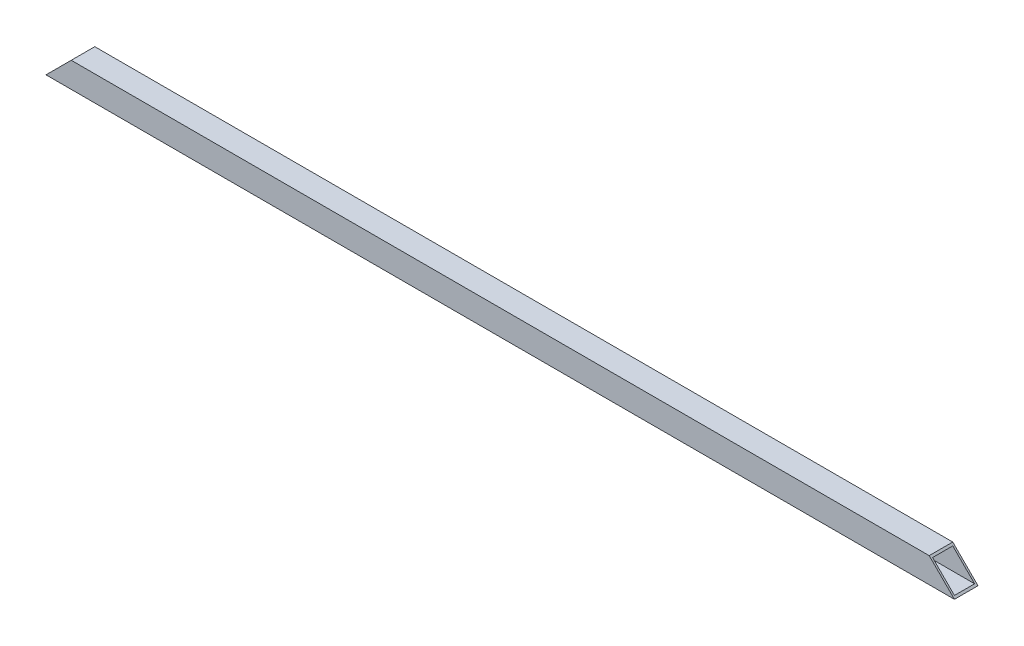
ISO-10303-21;
HEADER;
FILE_DESCRIPTION(('STEP AP214'),'2;1');
FILE_NAME('part.step','',(''),(''),'','','');
FILE_SCHEMA(('AUTOMOTIVE_DESIGN { 1 0 10303 214 1 1 1 1 }'));
ENDSEC;
DATA;
#1=APPLICATION_CONTEXT('core data for automotive mechanical design processes');
#2=APPLICATION_PROTOCOL_DEFINITION('international standard','automotive_design',2000,#1);
#3=PRODUCT_CONTEXT('',#1,'mechanical');
#4=PRODUCT('Part','Part','',(#3));
#5=PRODUCT_RELATED_PRODUCT_CATEGORY('part','',(#4));
#6=PRODUCT_DEFINITION_FORMATION('','',#4);
#7=PRODUCT_DEFINITION_CONTEXT('part definition',#1,'design');
#8=PRODUCT_DEFINITION('design','',#6,#7);
#9=PRODUCT_DEFINITION_SHAPE('','',#8);
#10=(LENGTH_UNIT() NAMED_UNIT(*) SI_UNIT(.MILLI.,.METRE.));
#11=(NAMED_UNIT(*) PLANE_ANGLE_UNIT() SI_UNIT($,.RADIAN.));
#12=(NAMED_UNIT(*) SI_UNIT($,.STERADIAN.) SOLID_ANGLE_UNIT());
#13=UNCERTAINTY_MEASURE_WITH_UNIT(LENGTH_MEASURE(1.E-05),#10,'distance_accuracy_value','');
#14=(GEOMETRIC_REPRESENTATION_CONTEXT(3) GLOBAL_UNCERTAINTY_ASSIGNED_CONTEXT((#13)) GLOBAL_UNIT_ASSIGNED_CONTEXT((#10,
#11,#12)) REPRESENTATION_CONTEXT('',''));
#15=CARTESIAN_POINT('',(0.,0.,0.));
#16=DIRECTION('',(0.,0.,1.));
#17=DIRECTION('',(1.,0.,0.));
#18=AXIS2_PLACEMENT_3D('',#15,#16,#17);
#19=CARTESIAN_POINT('',(2700.,-32.5,35.));
#20=DIRECTION('',(0.,1.,0.));
#21=DIRECTION('',(0.,0.,1.));
#22=AXIS2_PLACEMENT_3D('',#19,#20,#21);
#23=PLANE('',#22);
#24=DIRECTION('',(-1.,0.,0.));
#25=VECTOR('',#24,1.);
#26=CARTESIAN_POINT('',(2700.,-32.5,30.));
#27=LINE('',#26,#25);
#28=CARTESIAN_POINT('',(2695.,-32.5,30.));
#29=VERTEX_POINT('',#28);
#30=CARTESIAN_POINT('',(4.99999999999989,-32.5,30.));
#31=VERTEX_POINT('',#30);
#32=EDGE_CURVE('E160',#29,#31,#27,.T.);
#33=ORIENTED_EDGE('',*,*,#32,.F.);
#34=DIRECTION('',(0.,0.,-1.));
#35=VECTOR('',#34,1.);
#36=CARTESIAN_POINT('',(2695.,-32.5,35.));
#37=LINE('',#36,#35);
#38=CARTESIAN_POINT('',(2695.,-32.5,-30.));
#39=VERTEX_POINT('',#38);
#40=EDGE_CURVE('E13',#29,#39,#37,.T.);
#41=ORIENTED_EDGE('',*,*,#40,.T.);
#42=DIRECTION('',(-1.,0.,0.));
#43=VECTOR('',#42,1.);
#44=CARTESIAN_POINT('',(2700.,-32.5,-30.));
#45=LINE('',#44,#43);
#46=CARTESIAN_POINT('',(4.99999999999987,-32.5,-30.));
#47=VERTEX_POINT('',#46);
#48=EDGE_CURVE('E162',#39,#47,#45,.T.);
#49=ORIENTED_EDGE('',*,*,#48,.T.);
#50=DIRECTION('',(0.,0.,1.));
#51=VECTOR('',#50,1.);
#52=CARTESIAN_POINT('',(4.99999999999989,-32.5,35.0000000000008));
#53=LINE('',#52,#51);
#54=EDGE_CURVE('E67',#47,#31,#53,.T.);
#55=ORIENTED_EDGE('',*,*,#54,.T.);
#56=EDGE_LOOP('',(#33,#41,#49,#55));
#57=FACE_BOUND('',#56,.T.);
#58=ADVANCED_FACE('F59',(#57),#23,.T.);
#59=CARTESIAN_POINT('',(2700.,37.5,30.));
#60=DIRECTION('',(0.,0.,-1.));
#61=DIRECTION('',(0.,1.,0.));
#62=AXIS2_PLACEMENT_3D('',#59,#60,#61);
#63=PLANE('',#62);
#64=DIRECTION('',(-1.,0.,0.));
#65=VECTOR('',#64,1.);
#66=CARTESIAN_POINT('',(2700.,32.5,30.));
#67=LINE('',#66,#65);
#68=CARTESIAN_POINT('',(2630.,32.5,30.));
#69=VERTEX_POINT('',#68);
#70=CARTESIAN_POINT('',(69.9999999999998,32.5,30.));
#71=VERTEX_POINT('',#70);
#72=EDGE_CURVE('E170',#69,#71,#67,.T.);
#73=ORIENTED_EDGE('',*,*,#72,.F.);
#74=DIRECTION('',(0.707106781186546,-0.707106781186549,0.));
#75=VECTOR('',#74,1.);
#76=CARTESIAN_POINT('',(2662.5,1.17961196366423E-13,30.));
#77=LINE('',#76,#75);
#78=EDGE_CURVE('E169',#69,#29,#77,.T.);
#79=ORIENTED_EDGE('',*,*,#78,.T.);
#80=ORIENTED_EDGE('',*,*,#32,.T.);
#81=DIRECTION('',(0.707106781186546,0.707106781186549,0.));
#82=VECTOR('',#81,1.);
#83=CARTESIAN_POINT('',(1387.5,1350.,30.0000000000001));
#84=LINE('',#83,#82);
#85=EDGE_CURVE('E81',#31,#71,#84,.T.);
#86=ORIENTED_EDGE('',*,*,#85,.T.);
#87=EDGE_LOOP('',(#73,#79,#80,#86));
#88=FACE_BOUND('',#87,.T.);
#89=ADVANCED_FACE('F167',(#88),#63,.T.);
#90=CARTESIAN_POINT('',(2700.,32.5,35.));
#91=DIRECTION('',(0.,-1.,0.));
#92=DIRECTION('',(0.,0.,-1.));
#93=AXIS2_PLACEMENT_3D('',#90,#91,#92);
#94=PLANE('',#93);
#95=DIRECTION('',(-1.,0.,0.));
#96=VECTOR('',#95,1.);
#97=CARTESIAN_POINT('',(2700.,32.5,-30.));
#98=LINE('',#97,#96);
#99=CARTESIAN_POINT('',(2630.,32.5,-30.));
#100=VERTEX_POINT('',#99);
#101=CARTESIAN_POINT('',(69.9999999999998,32.5,-30.));
#102=VERTEX_POINT('',#101);
#103=EDGE_CURVE('E134',#100,#102,#98,.T.);
#104=ORIENTED_EDGE('',*,*,#103,.F.);
#105=DIRECTION('',(0.,0.,1.));
#106=VECTOR('',#105,1.);
#107=CARTESIAN_POINT('',(2630.,32.5,35.));
#108=LINE('',#107,#106);
#109=EDGE_CURVE('E199',#100,#69,#108,.T.);
#110=ORIENTED_EDGE('',*,*,#109,.T.);
#111=ORIENTED_EDGE('',*,*,#72,.T.);
#112=DIRECTION('',(0.,0.,-1.));
#113=VECTOR('',#112,1.);
#114=CARTESIAN_POINT('',(69.9999999999998,32.5,35.0000000000007));
#115=LINE('',#114,#113);
#116=EDGE_CURVE('E193',#71,#102,#115,.T.);
#117=ORIENTED_EDGE('',*,*,#116,.T.);
#118=EDGE_LOOP('',(#104,#110,#111,#117));
#119=FACE_BOUND('',#118,.T.);
#120=ADVANCED_FACE('F205',(#119),#94,.T.);
#121=CARTESIAN_POINT('',(2700.,37.5,-30.));
#122=DIRECTION('',(0.,0.,1.));
#123=DIRECTION('',(0.,-1.,0.));
#124=AXIS2_PLACEMENT_3D('',#121,#122,#123);
#125=PLANE('',#124);
#126=ORIENTED_EDGE('',*,*,#48,.F.);
#127=DIRECTION('',(-0.707106781186546,0.707106781186549,0.));
#128=VECTOR('',#127,1.);
#129=CARTESIAN_POINT('',(2662.5,1.2490009027033E-13,-30.));
#130=LINE('',#129,#128);
#131=EDGE_CURVE('E74',#39,#100,#130,.T.);
#132=ORIENTED_EDGE('',*,*,#131,.T.);
#133=ORIENTED_EDGE('',*,*,#103,.T.);
#134=DIRECTION('',(-0.707106781186546,-0.707106781186549,0.));
#135=VECTOR('',#134,1.);
#136=CARTESIAN_POINT('',(1387.5,1350.,-29.9999999999996));
#137=LINE('',#136,#135);
#138=EDGE_CURVE('E196',#102,#47,#137,.T.);
#139=ORIENTED_EDGE('',*,*,#138,.T.);
#140=EDGE_LOOP('',(#126,#132,#133,#139));
#141=FACE_BOUND('',#140,.T.);
#142=ADVANCED_FACE('F203',(#141),#125,.T.);
#143=CARTESIAN_POINT('',(74.9999999999997,37.5,35.));
#144=DIRECTION('',(-0.707106781186549,0.707106781186546,0.));
#145=DIRECTION('',(-0.707106781186546,-0.707106781186549,0.));
#146=AXIS2_PLACEMENT_3D('',#143,#144,#145);
#147=PLANE('',#146);
#148=ORIENTED_EDGE('',*,*,#116,.F.);
#149=ORIENTED_EDGE('',*,*,#85,.F.);
#150=ORIENTED_EDGE('',*,*,#54,.F.);
#151=ORIENTED_EDGE('',*,*,#138,.F.);
#152=EDGE_LOOP('',(#148,#149,#150,#151));
#153=FACE_BOUND('',#152,.T.);
#154=DIRECTION('',(0.707106781186546,0.707106781186549,0.));
#155=VECTOR('',#154,1.);
#156=CARTESIAN_POINT('',(74.9999999999997,37.5,-35.));
#157=LINE('',#156,#155);
#158=CARTESIAN_POINT('',(0.,-37.5,-35.));
#159=VERTEX_POINT('',#158);
#160=CARTESIAN_POINT('',(74.9999999999997,37.5,-35.));
#161=VERTEX_POINT('',#160);
#162=EDGE_CURVE('E128',#159,#161,#157,.T.);
#163=ORIENTED_EDGE('',*,*,#162,.F.);
#164=DIRECTION('',(0.,0.,-1.));
#165=VECTOR('',#164,1.);
#166=CARTESIAN_POINT('',(0.,-37.5,35.));
#167=LINE('',#166,#165);
#168=CARTESIAN_POINT('',(0.,-37.5,35.));
#169=VERTEX_POINT('',#168);
#170=EDGE_CURVE('E122',#169,#159,#167,.T.);
#171=ORIENTED_EDGE('',*,*,#170,.F.);
#172=DIRECTION('',(0.707106781186546,0.707106781186549,0.));
#173=VECTOR('',#172,1.);
#174=CARTESIAN_POINT('',(74.9999999999997,37.5,35.));
#175=LINE('',#174,#173);
#176=CARTESIAN_POINT('',(74.9999999999997,37.5,35.));
#177=VERTEX_POINT('',#176);
#178=EDGE_CURVE('E125',#169,#177,#175,.T.);
#179=ORIENTED_EDGE('',*,*,#178,.T.);
#180=DIRECTION('',(0.,0.,-1.));
#181=VECTOR('',#180,1.);
#182=CARTESIAN_POINT('',(74.9999999999997,37.5,35.));
#183=LINE('',#182,#181);
#184=EDGE_CURVE('E190',#177,#161,#183,.T.);
#185=ORIENTED_EDGE('',*,*,#184,.T.);
#186=EDGE_LOOP('',(#163,#171,#179,#185));
#187=FACE_BOUND('',#186,.T.);
#188=ADVANCED_FACE('F124',(#153,#187),#147,.T.);
#189=CARTESIAN_POINT('',(2700.,-37.5,35.));
#190=DIRECTION('',(0.707106781186549,0.707106781186546,0.));
#191=DIRECTION('',(-0.707106781186546,0.707106781186549,0.));
#192=AXIS2_PLACEMENT_3D('',#189,#190,#191);
#193=PLANE('',#192);
#194=ORIENTED_EDGE('',*,*,#40,.F.);
#195=ORIENTED_EDGE('',*,*,#78,.F.);
#196=ORIENTED_EDGE('',*,*,#109,.F.);
#197=ORIENTED_EDGE('',*,*,#131,.F.);
#198=EDGE_LOOP('',(#194,#195,#196,#197));
#199=FACE_BOUND('',#198,.T.);
#200=DIRECTION('',(0.707106781186546,-0.707106781186549,0.));
#201=VECTOR('',#200,1.);
#202=CARTESIAN_POINT('',(2700.,-37.5,-35.));
#203=LINE('',#202,#201);
#204=CARTESIAN_POINT('',(2625.,37.5,-35.));
#205=VERTEX_POINT('',#204);
#206=CARTESIAN_POINT('',(2700.,-37.5,-35.));
#207=VERTEX_POINT('',#206);
#208=EDGE_CURVE('E146',#205,#207,#203,.T.);
#209=ORIENTED_EDGE('',*,*,#208,.F.);
#210=DIRECTION('',(0.,0.,-1.));
#211=VECTOR('',#210,1.);
#212=CARTESIAN_POINT('',(2625.,37.5,35.));
#213=LINE('',#212,#211);
#214=CARTESIAN_POINT('',(2625.,37.5,35.));
#215=VERTEX_POINT('',#214);
#216=EDGE_CURVE('E188',#215,#205,#213,.T.);
#217=ORIENTED_EDGE('',*,*,#216,.F.);
#218=DIRECTION('',(0.707106781186546,-0.707106781186549,0.));
#219=VECTOR('',#218,1.);
#220=CARTESIAN_POINT('',(2700.,-37.5,35.));
#221=LINE('',#220,#219);
#222=CARTESIAN_POINT('',(2700.,-37.5,35.));
#223=VERTEX_POINT('',#222);
#224=EDGE_CURVE('E145',#215,#223,#221,.T.);
#225=ORIENTED_EDGE('',*,*,#224,.T.);
#226=DIRECTION('',(0.,0.,-1.));
#227=VECTOR('',#226,1.);
#228=CARTESIAN_POINT('',(2700.,-37.5,35.));
#229=LINE('',#228,#227);
#230=EDGE_CURVE('E133',#223,#207,#229,.T.);
#231=ORIENTED_EDGE('',*,*,#230,.T.);
#232=EDGE_LOOP('',(#209,#217,#225,#231));
#233=FACE_BOUND('',#232,.T.);
#234=ADVANCED_FACE('F180',(#199,#233),#193,.T.);
#235=CARTESIAN_POINT('',(2700.,37.5,-35.));
#236=DIRECTION('',(0.,0.,1.));
#237=DIRECTION('',(0.,-1.,0.));
#238=AXIS2_PLACEMENT_3D('',#235,#236,#237);
#239=PLANE('',#238);
#240=ORIENTED_EDGE('',*,*,#208,.T.);
#241=DIRECTION('',(-1.,0.,0.));
#242=VECTOR('',#241,1.);
#243=CARTESIAN_POINT('',(2700.,-37.5,-35.));
#244=LINE('',#243,#242);
#245=EDGE_CURVE('E149',#207,#159,#244,.T.);
#246=ORIENTED_EDGE('',*,*,#245,.T.);
#247=ORIENTED_EDGE('',*,*,#162,.T.);
#248=DIRECTION('',(-1.,0.,0.));
#249=VECTOR('',#248,1.);
#250=CARTESIAN_POINT('',(2700.,37.5,-35.));
#251=LINE('',#250,#249);
#252=EDGE_CURVE('E151',#205,#161,#251,.T.);
#253=ORIENTED_EDGE('',*,*,#252,.F.);
#254=EDGE_LOOP('',(#240,#246,#247,#253));
#255=FACE_BOUND('',#254,.T.);
#256=ADVANCED_FACE('F61',(#255),#239,.F.);
#257=CARTESIAN_POINT('',(2700.,37.5,35.));
#258=DIRECTION('',(0.,-1.,0.));
#259=DIRECTION('',(0.,0.,-1.));
#260=AXIS2_PLACEMENT_3D('',#257,#258,#259);
#261=PLANE('',#260);
#262=ORIENTED_EDGE('',*,*,#216,.T.);
#263=ORIENTED_EDGE('',*,*,#252,.T.);
#264=ORIENTED_EDGE('',*,*,#184,.F.);
#265=DIRECTION('',(-1.,0.,0.));
#266=VECTOR('',#265,1.);
#267=CARTESIAN_POINT('',(2700.,37.5,35.));
#268=LINE('',#267,#266);
#269=EDGE_CURVE('E144',#215,#177,#268,.T.);
#270=ORIENTED_EDGE('',*,*,#269,.F.);
#271=EDGE_LOOP('',(#262,#263,#264,#270));
#272=FACE_BOUND('',#271,.T.);
#273=ADVANCED_FACE('F226',(#272),#261,.F.);
#274=CARTESIAN_POINT('',(2700.,37.5,35.));
#275=DIRECTION('',(0.,0.,-1.));
#276=DIRECTION('',(0.,1.,0.));
#277=AXIS2_PLACEMENT_3D('',#274,#275,#276);
#278=PLANE('',#277);
#279=ORIENTED_EDGE('',*,*,#224,.F.);
#280=ORIENTED_EDGE('',*,*,#269,.T.);
#281=ORIENTED_EDGE('',*,*,#178,.F.);
#282=DIRECTION('',(-1.,0.,0.));
#283=VECTOR('',#282,1.);
#284=CARTESIAN_POINT('',(2700.,-37.5,35.));
#285=LINE('',#284,#283);
#286=EDGE_CURVE('E141',#223,#169,#285,.T.);
#287=ORIENTED_EDGE('',*,*,#286,.F.);
#288=EDGE_LOOP('',(#279,#280,#281,#287));
#289=FACE_BOUND('',#288,.T.);
#290=ADVANCED_FACE('F140',(#289),#278,.F.);
#291=CARTESIAN_POINT('',(2700.,-37.5,35.));
#292=DIRECTION('',(0.,1.,0.));
#293=DIRECTION('',(0.,0.,1.));
#294=AXIS2_PLACEMENT_3D('',#291,#292,#293);
#295=PLANE('',#294);
#296=ORIENTED_EDGE('',*,*,#170,.T.);
#297=ORIENTED_EDGE('',*,*,#245,.F.);
#298=ORIENTED_EDGE('',*,*,#230,.F.);
#299=ORIENTED_EDGE('',*,*,#286,.T.);
#300=EDGE_LOOP('',(#296,#297,#298,#299));
#301=FACE_BOUND('',#300,.T.);
#302=ADVANCED_FACE('F148',(#301),#295,.F.);
#303=CLOSED_SHELL('',(#58,#89,#120,#142,#188,#234,#256,#273,#290,#302));
#304=MANIFOLD_SOLID_BREP('B2',#303);
#305=ADVANCED_BREP_SHAPE_REPRESENTATION('',(#18,#304),#14);
#306=SHAPE_DEFINITION_REPRESENTATION(#9,#305);
ENDSEC;
END-ISO-10303-21;
